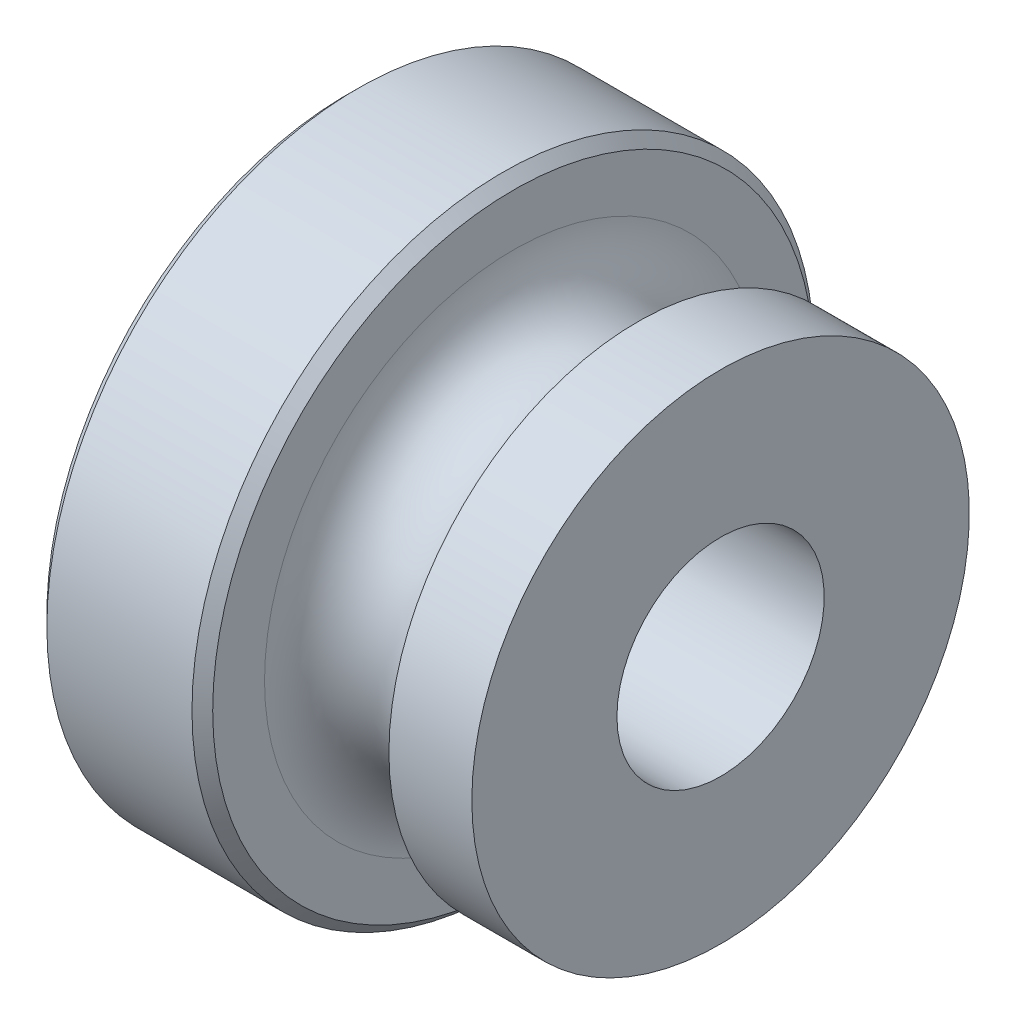
ISO-10303-21;
HEADER;
FILE_DESCRIPTION(('STEP AP214'),'2;1');
FILE_NAME('part.step','',(''),(''),'','','');
FILE_SCHEMA(('AUTOMOTIVE_DESIGN { 1 0 10303 214 1 1 1 1 }'));
ENDSEC;
DATA;
#1=APPLICATION_CONTEXT('core data for automotive mechanical design processes');
#2=APPLICATION_PROTOCOL_DEFINITION('international standard','automotive_design',2000,#1);
#3=PRODUCT_CONTEXT('',#1,'mechanical');
#4=PRODUCT('Part','Part','',(#3));
#5=PRODUCT_RELATED_PRODUCT_CATEGORY('part','',(#4));
#6=PRODUCT_DEFINITION_FORMATION('','',#4);
#7=PRODUCT_DEFINITION_CONTEXT('part definition',#1,'design');
#8=PRODUCT_DEFINITION('design','',#6,#7);
#9=PRODUCT_DEFINITION_SHAPE('','',#8);
#10=(LENGTH_UNIT() NAMED_UNIT(*) SI_UNIT(.MILLI.,.METRE.));
#11=(NAMED_UNIT(*) PLANE_ANGLE_UNIT() SI_UNIT($,.RADIAN.));
#12=(NAMED_UNIT(*) SI_UNIT($,.STERADIAN.) SOLID_ANGLE_UNIT());
#13=UNCERTAINTY_MEASURE_WITH_UNIT(LENGTH_MEASURE(1.E-05),#10,'distance_accuracy_value','');
#14=(GEOMETRIC_REPRESENTATION_CONTEXT(3) GLOBAL_UNCERTAINTY_ASSIGNED_CONTEXT((#13)) GLOBAL_UNIT_ASSIGNED_CONTEXT((#10,
#11,#12)) REPRESENTATION_CONTEXT('',''));
#15=CARTESIAN_POINT('',(0.,0.,0.));
#16=DIRECTION('',(0.,0.,1.));
#17=DIRECTION('',(1.,0.,0.));
#18=AXIS2_PLACEMENT_3D('',#15,#16,#17);
#19=CARTESIAN_POINT('',(0.,0.,0.));
#20=DIRECTION('',(-1.,0.,0.));
#21=DIRECTION('',(0.,0.,1.));
#22=AXIS2_PLACEMENT_3D('',#19,#20,#21);
#23=CYLINDRICAL_SURFACE('',#22,5.);
#24=CARTESIAN_POINT('',(18.,0.,0.));
#25=DIRECTION('',(-1.,0.,0.));
#26=DIRECTION('',(0.,0.,1.));
#27=AXIS2_PLACEMENT_3D('',#24,#25,#26);
#28=CIRCLE('',#27,5.);
#29=CARTESIAN_POINT('',(18.,0.,5.));
#30=VERTEX_POINT('',#29);
#31=EDGE_CURVE('E66',#30,#30,#28,.T.);
#32=ORIENTED_EDGE('',*,*,#31,.F.);
#33=EDGE_LOOP('',(#32));
#34=FACE_BOUND('',#33,.T.);
#35=CARTESIAN_POINT('',(3.,0.,0.));
#36=DIRECTION('',(-1.,0.,0.));
#37=DIRECTION('',(0.,0.,1.));
#38=AXIS2_PLACEMENT_3D('',#35,#36,#37);
#39=CIRCLE('',#38,5.);
#40=CARTESIAN_POINT('',(3.,0.,5.));
#41=VERTEX_POINT('',#40);
#42=EDGE_CURVE('E84',#41,#41,#39,.T.);
#43=ORIENTED_EDGE('',*,*,#42,.T.);
#44=EDGE_LOOP('',(#43));
#45=FACE_BOUND('',#44,.T.);
#46=ADVANCED_FACE('F45',(#34,#45),#23,.F.);
#47=CARTESIAN_POINT('',(18.,12.,0.));
#48=DIRECTION('',(-1.,0.,0.));
#49=DIRECTION('',(0.,0.,1.));
#50=AXIS2_PLACEMENT_3D('',#47,#48,#49);
#51=PLANE('',#50);
#52=CARTESIAN_POINT('',(18.,0.,0.));
#53=DIRECTION('',(-1.,0.,0.));
#54=DIRECTION('',(0.,0.,1.));
#55=AXIS2_PLACEMENT_3D('',#52,#53,#54);
#56=CIRCLE('',#55,12.);
#57=CARTESIAN_POINT('',(18.,0.,12.));
#58=VERTEX_POINT('',#57);
#59=EDGE_CURVE('E69',#58,#58,#56,.T.);
#60=ORIENTED_EDGE('',*,*,#59,.F.);
#61=EDGE_LOOP('',(#60));
#62=FACE_BOUND('',#61,.T.);
#63=ORIENTED_EDGE('',*,*,#31,.T.);
#64=EDGE_LOOP('',(#63));
#65=FACE_BOUND('',#64,.T.);
#66=ADVANCED_FACE('F113',(#62,#65),#51,.F.);
#67=CARTESIAN_POINT('',(0.,0.,0.));
#68=DIRECTION('',(-1.,0.,0.));
#69=DIRECTION('',(0.,0.,1.));
#70=AXIS2_PLACEMENT_3D('',#67,#68,#69);
#71=CYLINDRICAL_SURFACE('',#70,12.);
#72=CARTESIAN_POINT('',(14.,0.,0.));
#73=DIRECTION('',(-1.,0.,0.));
#74=DIRECTION('',(0.,0.,1.));
#75=AXIS2_PLACEMENT_3D('',#72,#73,#74);
#76=CIRCLE('',#75,12.);
#77=CARTESIAN_POINT('',(14.,0.,12.));
#78=VERTEX_POINT('',#77);
#79=EDGE_CURVE('E72',#78,#78,#76,.T.);
#80=ORIENTED_EDGE('',*,*,#79,.F.);
#81=EDGE_LOOP('',(#80));
#82=FACE_BOUND('',#81,.T.);
#83=ORIENTED_EDGE('',*,*,#59,.T.);
#84=EDGE_LOOP('',(#83));
#85=FACE_BOUND('',#84,.T.);
#86=ADVANCED_FACE('F119',(#82,#85),#71,.T.);
#87=CARTESIAN_POINT('',(11.,0.,0.));
#88=DIRECTION('',(-1.,0.,0.));
#89=DIRECTION('',(0.,0.,1.));
#90=AXIS2_PLACEMENT_3D('',#87,#88,#89);
#91=TOROIDAL_SURFACE('',#90,12.,3.);
#92=CARTESIAN_POINT('',(8.,0.,0.));
#93=DIRECTION('',(-1.,0.,0.));
#94=DIRECTION('',(0.,0.,1.));
#95=AXIS2_PLACEMENT_3D('',#92,#93,#94);
#96=CIRCLE('',#95,12.);
#97=CARTESIAN_POINT('',(8.,0.,12.));
#98=VERTEX_POINT('',#97);
#99=EDGE_CURVE('E75',#98,#98,#96,.T.);
#100=ORIENTED_EDGE('',*,*,#99,.F.);
#101=EDGE_LOOP('',(#100));
#102=FACE_BOUND('',#101,.T.);
#103=ORIENTED_EDGE('',*,*,#79,.T.);
#104=EDGE_LOOP('',(#103));
#105=FACE_BOUND('',#104,.T.);
#106=ADVANCED_FACE('F169',(#102,#105),#91,.F.);
#107=CARTESIAN_POINT('',(8.,15.,0.));
#108=DIRECTION('',(-1.,0.,0.));
#109=DIRECTION('',(0.,0.,1.));
#110=AXIS2_PLACEMENT_3D('',#107,#108,#109);
#111=PLANE('',#110);
#112=CARTESIAN_POINT('',(8.,0.,0.));
#113=DIRECTION('',(-1.,0.,0.));
#114=DIRECTION('',(0.,0.,1.));
#115=AXIS2_PLACEMENT_3D('',#112,#113,#114);
#116=CIRCLE('',#115,14.5);
#117=CARTESIAN_POINT('',(8.,0.,14.5));
#118=VERTEX_POINT('',#117);
#119=EDGE_CURVE('E53',#118,#118,#116,.F.);
#120=ORIENTED_EDGE('',*,*,#119,.T.);
#121=EDGE_LOOP('',(#120));
#122=FACE_BOUND('',#121,.T.);
#123=ORIENTED_EDGE('',*,*,#99,.T.);
#124=EDGE_LOOP('',(#123));
#125=FACE_BOUND('',#124,.T.);
#126=ADVANCED_FACE('F109',(#122,#125),#111,.F.);
#127=CARTESIAN_POINT('',(0.,0.,0.));
#128=DIRECTION('',(-1.,0.,0.));
#129=DIRECTION('',(0.,0.,1.));
#130=AXIS2_PLACEMENT_3D('',#127,#128,#129);
#131=CYLINDRICAL_SURFACE('',#130,15.);
#132=CARTESIAN_POINT('',(7.50000000000001,0.,0.));
#133=DIRECTION('',(-1.,0.,0.));
#134=DIRECTION('',(0.,0.,1.));
#135=AXIS2_PLACEMENT_3D('',#132,#133,#134);
#136=CIRCLE('',#135,15.);
#137=CARTESIAN_POINT('',(7.50000000000001,0.,15.));
#138=VERTEX_POINT('',#137);
#139=EDGE_CURVE('E57',#138,#138,#136,.T.);
#140=ORIENTED_EDGE('',*,*,#139,.T.);
#141=EDGE_LOOP('',(#140));
#142=FACE_BOUND('',#141,.T.);
#143=CARTESIAN_POINT('',(0.499999999999997,0.,0.));
#144=DIRECTION('',(1.,0.,0.));
#145=DIRECTION('',(0.,0.,-1.));
#146=AXIS2_PLACEMENT_3D('',#143,#144,#145);
#147=CIRCLE('',#146,15.);
#148=CARTESIAN_POINT('',(0.499999999999997,0.,-15.));
#149=VERTEX_POINT('',#148);
#150=EDGE_CURVE('E61',#149,#149,#147,.T.);
#151=ORIENTED_EDGE('',*,*,#150,.T.);
#152=EDGE_LOOP('',(#151));
#153=FACE_BOUND('',#152,.T.);
#154=ADVANCED_FACE('F104',(#142,#153),#131,.T.);
#155=CARTESIAN_POINT('',(0.,10.,0.));
#156=DIRECTION('',(1.,0.,0.));
#157=DIRECTION('',(0.,0.,-1.));
#158=AXIS2_PLACEMENT_3D('',#155,#156,#157);
#159=PLANE('',#158);
#160=CARTESIAN_POINT('',(0.,0.,0.));
#161=DIRECTION('',(1.,0.,0.));
#162=DIRECTION('',(0.,0.,-1.));
#163=AXIS2_PLACEMENT_3D('',#160,#161,#162);
#164=CIRCLE('',#163,14.5);
#165=CARTESIAN_POINT('',(0.,0.,-14.5));
#166=VERTEX_POINT('',#165);
#167=EDGE_CURVE('E10',#166,#166,#164,.F.);
#168=ORIENTED_EDGE('',*,*,#167,.T.);
#169=EDGE_LOOP('',(#168));
#170=FACE_BOUND('',#169,.T.);
#171=CARTESIAN_POINT('',(0.,0.,0.));
#172=DIRECTION('',(-1.,0.,0.));
#173=DIRECTION('',(0.,0.,1.));
#174=AXIS2_PLACEMENT_3D('',#171,#172,#173);
#175=CIRCLE('',#174,10.);
#176=CARTESIAN_POINT('',(0.,0.,10.));
#177=VERTEX_POINT('',#176);
#178=EDGE_CURVE('E78',#177,#177,#175,.T.);
#179=ORIENTED_EDGE('',*,*,#178,.F.);
#180=EDGE_LOOP('',(#179));
#181=FACE_BOUND('',#180,.T.);
#182=ADVANCED_FACE('F99',(#170,#181),#159,.F.);
#183=CARTESIAN_POINT('',(0.,0.,0.));
#184=DIRECTION('',(-1.,0.,0.));
#185=DIRECTION('',(0.,0.,1.));
#186=AXIS2_PLACEMENT_3D('',#183,#184,#185);
#187=TOROIDAL_SURFACE('',#186,7.,3.);
#188=CARTESIAN_POINT('',(3.,0.,0.));
#189=DIRECTION('',(-1.,0.,0.));
#190=DIRECTION('',(0.,0.,1.));
#191=AXIS2_PLACEMENT_3D('',#188,#189,#190);
#192=CIRCLE('',#191,7.);
#193=CARTESIAN_POINT('',(3.,0.,7.));
#194=VERTEX_POINT('',#193);
#195=EDGE_CURVE('E81',#194,#194,#192,.T.);
#196=ORIENTED_EDGE('',*,*,#195,.F.);
#197=EDGE_LOOP('',(#196));
#198=FACE_BOUND('',#197,.T.);
#199=ORIENTED_EDGE('',*,*,#178,.T.);
#200=EDGE_LOOP('',(#199));
#201=FACE_BOUND('',#200,.T.);
#202=ADVANCED_FACE('F93',(#198,#201),#187,.F.);
#203=CARTESIAN_POINT('',(3.,5.,0.));
#204=DIRECTION('',(1.,0.,0.));
#205=DIRECTION('',(0.,0.,-1.));
#206=AXIS2_PLACEMENT_3D('',#203,#204,#205);
#207=PLANE('',#206);
#208=ORIENTED_EDGE('',*,*,#42,.F.);
#209=EDGE_LOOP('',(#208));
#210=FACE_BOUND('',#209,.T.);
#211=ORIENTED_EDGE('',*,*,#195,.T.);
#212=EDGE_LOOP('',(#211));
#213=FACE_BOUND('',#212,.T.);
#214=ADVANCED_FACE('F89',(#210,#213),#207,.F.);
#215=CARTESIAN_POINT('',(7.50000000000001,0.,0.));
#216=DIRECTION('',(-1.,0.,0.));
#217=DIRECTION('',(0.,0.,1.));
#218=AXIS2_PLACEMENT_3D('',#215,#216,#217);
#219=CONICAL_SURFACE('',#218,15.,0.785398163397452);
#220=ORIENTED_EDGE('',*,*,#119,.F.);
#221=EDGE_LOOP('',(#220));
#222=FACE_BOUND('',#221,.T.);
#223=ORIENTED_EDGE('',*,*,#139,.F.);
#224=EDGE_LOOP('',(#223));
#225=FACE_BOUND('',#224,.T.);
#226=ADVANCED_FACE('F92',(#222,#225),#219,.T.);
#227=CARTESIAN_POINT('',(0.,0.,0.));
#228=DIRECTION('',(1.,0.,0.));
#229=DIRECTION('',(0.,0.,-1.));
#230=AXIS2_PLACEMENT_3D('',#227,#228,#229);
#231=CONICAL_SURFACE('',#230,14.5,0.785398163397453);
#232=ORIENTED_EDGE('',*,*,#150,.F.);
#233=EDGE_LOOP('',(#232));
#234=FACE_BOUND('',#233,.T.);
#235=ORIENTED_EDGE('',*,*,#167,.F.);
#236=EDGE_LOOP('',(#235));
#237=FACE_BOUND('',#236,.T.);
#238=ADVANCED_FACE('F48',(#234,#237),#231,.T.);
#239=CLOSED_SHELL('',(#46,#66,#86,#106,#126,#154,#182,#202,#214,#226,#238));
#240=MANIFOLD_SOLID_BREP('B2',#239);
#241=ADVANCED_BREP_SHAPE_REPRESENTATION('',(#18,#240),#14);
#242=SHAPE_DEFINITION_REPRESENTATION(#9,#241);
ENDSEC;
END-ISO-10303-21;
